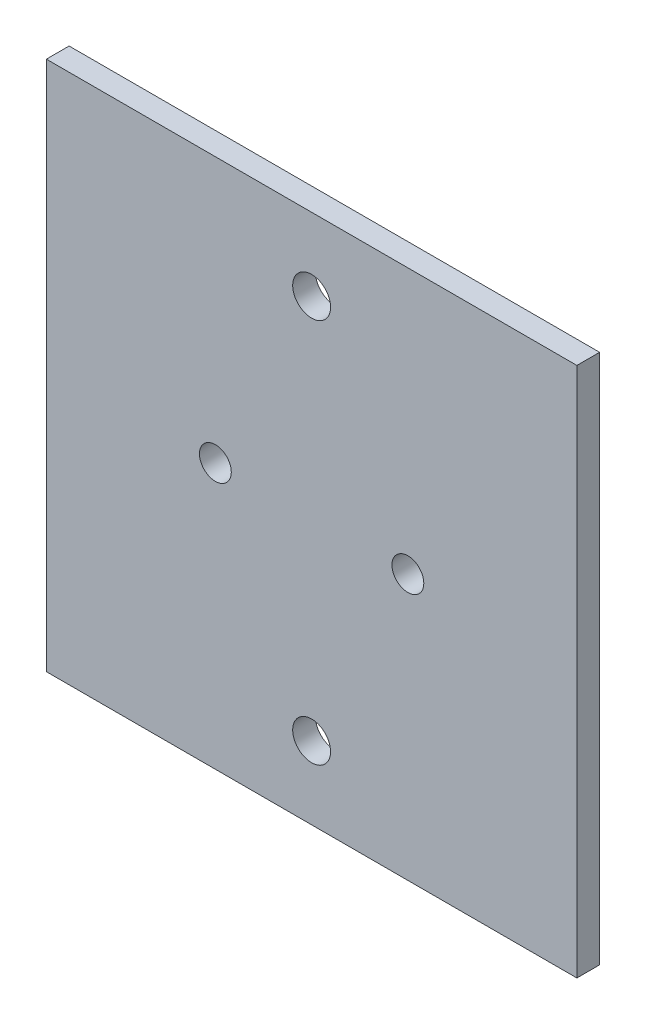
ISO-10303-21;
HEADER;
FILE_DESCRIPTION(('STEP AP214'),'2;1');
FILE_NAME('part.step','',(''),(''),'','','');
FILE_SCHEMA(('AUTOMOTIVE_DESIGN { 1 0 10303 214 1 1 1 1 }'));
ENDSEC;
DATA;
#1=APPLICATION_CONTEXT('core data for automotive mechanical design processes');
#2=APPLICATION_PROTOCOL_DEFINITION('international standard','automotive_design',2000,#1);
#3=PRODUCT_CONTEXT('',#1,'mechanical');
#4=PRODUCT('Part','Part','',(#3));
#5=PRODUCT_RELATED_PRODUCT_CATEGORY('part','',(#4));
#6=PRODUCT_DEFINITION_FORMATION('','',#4);
#7=PRODUCT_DEFINITION_CONTEXT('part definition',#1,'design');
#8=PRODUCT_DEFINITION('design','',#6,#7);
#9=PRODUCT_DEFINITION_SHAPE('','',#8);
#10=(LENGTH_UNIT() NAMED_UNIT(*) SI_UNIT(.MILLI.,.METRE.));
#11=(NAMED_UNIT(*) PLANE_ANGLE_UNIT() SI_UNIT($,.RADIAN.));
#12=(NAMED_UNIT(*) SI_UNIT($,.STERADIAN.) SOLID_ANGLE_UNIT());
#13=UNCERTAINTY_MEASURE_WITH_UNIT(LENGTH_MEASURE(1.E-05),#10,'distance_accuracy_value','');
#14=(GEOMETRIC_REPRESENTATION_CONTEXT(3) GLOBAL_UNCERTAINTY_ASSIGNED_CONTEXT((#13)) GLOBAL_UNIT_ASSIGNED_CONTEXT((#10,
#11,#12)) REPRESENTATION_CONTEXT('',''));
#15=CARTESIAN_POINT('',(0.,0.,0.));
#16=DIRECTION('',(0.,0.,1.));
#17=DIRECTION('',(1.,0.,0.));
#18=AXIS2_PLACEMENT_3D('',#15,#16,#17);
#19=CARTESIAN_POINT('',(0.,0.,3.));
#20=DIRECTION('',(0.,0.,1.));
#21=DIRECTION('',(1.,0.,0.));
#22=AXIS2_PLACEMENT_3D('',#19,#20,#21);
#23=PLANE('',#22);
#24=CARTESIAN_POINT('',(-12.7,0.,3.));
#25=DIRECTION('',(0.,0.,1.));
#26=DIRECTION('',(1.,0.,0.));
#27=AXIS2_PLACEMENT_3D('',#24,#25,#26);
#28=CIRCLE('',#27,2.1);
#29=CARTESIAN_POINT('',(-10.6,0.,3.));
#30=VERTEX_POINT('',#29);
#31=EDGE_CURVE('E149',#30,#30,#28,.T.);
#32=ORIENTED_EDGE('',*,*,#31,.F.);
#33=EDGE_LOOP('',(#32));
#34=FACE_BOUND('',#33,.T.);
#35=CARTESIAN_POINT('',(12.7,0.,3.));
#36=DIRECTION('',(0.,0.,1.));
#37=DIRECTION('',(1.,0.,0.));
#38=AXIS2_PLACEMENT_3D('',#35,#36,#37);
#39=CIRCLE('',#38,2.1);
#40=CARTESIAN_POINT('',(14.8,0.,3.));
#41=VERTEX_POINT('',#40);
#42=EDGE_CURVE('E150',#41,#41,#39,.T.);
#43=ORIENTED_EDGE('',*,*,#42,.F.);
#44=EDGE_LOOP('',(#43));
#45=FACE_BOUND('',#44,.T.);
#46=CARTESIAN_POINT('',(0.,25.4,3.));
#47=DIRECTION('',(0.,0.,1.));
#48=DIRECTION('',(1.,0.,0.));
#49=AXIS2_PLACEMENT_3D('',#46,#47,#48);
#50=CIRCLE('',#49,2.5);
#51=CARTESIAN_POINT('',(2.49999999999999,25.4,3.));
#52=VERTEX_POINT('',#51);
#53=EDGE_CURVE('E111',#52,#52,#50,.T.);
#54=ORIENTED_EDGE('',*,*,#53,.F.);
#55=EDGE_LOOP('',(#54));
#56=FACE_BOUND('',#55,.T.);
#57=DIRECTION('',(0.,1.,0.));
#58=VECTOR('',#57,1.);
#59=CARTESIAN_POINT('',(35.,35.,3.));
#60=LINE('',#59,#58);
#61=CARTESIAN_POINT('',(35.,-35.,3.));
#62=VERTEX_POINT('',#61);
#63=CARTESIAN_POINT('',(35.,35.,3.));
#64=VERTEX_POINT('',#63);
#65=EDGE_CURVE('E91',#62,#64,#60,.T.);
#66=ORIENTED_EDGE('',*,*,#65,.T.);
#67=DIRECTION('',(-1.,0.,0.));
#68=VECTOR('',#67,1.);
#69=CARTESIAN_POINT('',(-35.,35.,3.));
#70=LINE('',#69,#68);
#71=CARTESIAN_POINT('',(-35.,35.,3.));
#72=VERTEX_POINT('',#71);
#73=EDGE_CURVE('E86',#64,#72,#70,.T.);
#74=ORIENTED_EDGE('',*,*,#73,.T.);
#75=DIRECTION('',(0.,-1.,0.));
#76=VECTOR('',#75,1.);
#77=CARTESIAN_POINT('',(-35.,35.,3.));
#78=LINE('',#77,#76);
#79=CARTESIAN_POINT('',(-35.,-35.,3.));
#80=VERTEX_POINT('',#79);
#81=EDGE_CURVE('E89',#72,#80,#78,.T.);
#82=ORIENTED_EDGE('',*,*,#81,.T.);
#83=DIRECTION('',(1.,0.,0.));
#84=VECTOR('',#83,1.);
#85=CARTESIAN_POINT('',(-35.,-35.,3.));
#86=LINE('',#85,#84);
#87=EDGE_CURVE('E56',#80,#62,#86,.T.);
#88=ORIENTED_EDGE('',*,*,#87,.T.);
#89=EDGE_LOOP('',(#66,#74,#82,#88));
#90=FACE_BOUND('',#89,.T.);
#91=CARTESIAN_POINT('',(0.,-25.4,3.));
#92=DIRECTION('',(0.,0.,1.));
#93=DIRECTION('',(1.,0.,0.));
#94=AXIS2_PLACEMENT_3D('',#91,#92,#93);
#95=CIRCLE('',#94,2.5);
#96=CARTESIAN_POINT('',(2.5,-25.4,3.));
#97=VERTEX_POINT('',#96);
#98=EDGE_CURVE('E133',#97,#97,#95,.T.);
#99=ORIENTED_EDGE('',*,*,#98,.F.);
#100=EDGE_LOOP('',(#99));
#101=FACE_BOUND('',#100,.T.);
#102=ADVANCED_FACE('F38',(#34,#45,#56,#90,#101),#23,.T.);
#103=CARTESIAN_POINT('',(0.,0.,0.));
#104=DIRECTION('',(0.,0.,1.));
#105=DIRECTION('',(1.,0.,0.));
#106=AXIS2_PLACEMENT_3D('',#103,#104,#105);
#107=PLANE('',#106);
#108=CARTESIAN_POINT('',(-12.7,0.,0.));
#109=DIRECTION('',(0.,0.,1.));
#110=DIRECTION('',(1.,0.,0.));
#111=AXIS2_PLACEMENT_3D('',#108,#109,#110);
#112=CIRCLE('',#111,2.1);
#113=CARTESIAN_POINT('',(-10.6,0.,0.));
#114=VERTEX_POINT('',#113);
#115=EDGE_CURVE('E141',#114,#114,#112,.F.);
#116=ORIENTED_EDGE('',*,*,#115,.F.);
#117=EDGE_LOOP('',(#116));
#118=FACE_BOUND('',#117,.T.);
#119=CARTESIAN_POINT('',(12.7,0.,0.));
#120=DIRECTION('',(0.,0.,1.));
#121=DIRECTION('',(1.,0.,0.));
#122=AXIS2_PLACEMENT_3D('',#119,#120,#121);
#123=CIRCLE('',#122,2.1);
#124=CARTESIAN_POINT('',(14.8,0.,0.));
#125=VERTEX_POINT('',#124);
#126=EDGE_CURVE('E145',#125,#125,#123,.F.);
#127=ORIENTED_EDGE('',*,*,#126,.F.);
#128=EDGE_LOOP('',(#127));
#129=FACE_BOUND('',#128,.T.);
#130=DIRECTION('',(0.,1.,0.));
#131=VECTOR('',#130,1.);
#132=CARTESIAN_POINT('',(35.,35.,0.));
#133=LINE('',#132,#131);
#134=CARTESIAN_POINT('',(35.,-35.,0.));
#135=VERTEX_POINT('',#134);
#136=CARTESIAN_POINT('',(35.,35.,0.));
#137=VERTEX_POINT('',#136);
#138=EDGE_CURVE('E107',#135,#137,#133,.T.);
#139=ORIENTED_EDGE('',*,*,#138,.F.);
#140=DIRECTION('',(1.,0.,0.));
#141=VECTOR('',#140,1.);
#142=CARTESIAN_POINT('',(-35.,-35.,0.));
#143=LINE('',#142,#141);
#144=CARTESIAN_POINT('',(-35.,-35.,0.));
#145=VERTEX_POINT('',#144);
#146=EDGE_CURVE('E79',#145,#135,#143,.T.);
#147=ORIENTED_EDGE('',*,*,#146,.F.);
#148=DIRECTION('',(0.,-1.,0.));
#149=VECTOR('',#148,1.);
#150=CARTESIAN_POINT('',(-35.,35.,0.));
#151=LINE('',#150,#149);
#152=CARTESIAN_POINT('',(-35.,35.,0.));
#153=VERTEX_POINT('',#152);
#154=EDGE_CURVE('E73',#153,#145,#151,.T.);
#155=ORIENTED_EDGE('',*,*,#154,.F.);
#156=DIRECTION('',(-1.,0.,0.));
#157=VECTOR('',#156,1.);
#158=CARTESIAN_POINT('',(-35.,35.,0.));
#159=LINE('',#158,#157);
#160=EDGE_CURVE('E96',#137,#153,#159,.T.);
#161=ORIENTED_EDGE('',*,*,#160,.F.);
#162=EDGE_LOOP('',(#139,#147,#155,#161));
#163=FACE_BOUND('',#162,.T.);
#164=CARTESIAN_POINT('',(0.,25.4,0.));
#165=DIRECTION('',(0.,0.,1.));
#166=DIRECTION('',(1.,0.,0.));
#167=AXIS2_PLACEMENT_3D('',#164,#165,#166);
#168=CIRCLE('',#167,2.5);
#169=CARTESIAN_POINT('',(2.49999999999999,25.4,0.));
#170=VERTEX_POINT('',#169);
#171=EDGE_CURVE('E129',#170,#170,#168,.T.);
#172=ORIENTED_EDGE('',*,*,#171,.T.);
#173=EDGE_LOOP('',(#172));
#174=FACE_BOUND('',#173,.T.);
#175=CARTESIAN_POINT('',(0.,-25.4,0.));
#176=DIRECTION('',(0.,0.,1.));
#177=DIRECTION('',(1.,0.,0.));
#178=AXIS2_PLACEMENT_3D('',#175,#176,#177);
#179=CIRCLE('',#178,2.5);
#180=CARTESIAN_POINT('',(2.5,-25.4,0.));
#181=VERTEX_POINT('',#180);
#182=EDGE_CURVE('E137',#181,#181,#179,.T.);
#183=ORIENTED_EDGE('',*,*,#182,.T.);
#184=EDGE_LOOP('',(#183));
#185=FACE_BOUND('',#184,.T.);
#186=ADVANCED_FACE('F124',(#118,#129,#163,#174,#185),#107,.F.);
#187=CARTESIAN_POINT('',(35.,35.,3.));
#188=DIRECTION('',(-1.,0.,0.));
#189=DIRECTION('',(0.,-1.,0.));
#190=AXIS2_PLACEMENT_3D('',#187,#188,#189);
#191=PLANE('',#190);
#192=ORIENTED_EDGE('',*,*,#138,.T.);
#193=DIRECTION('',(0.,0.,-1.));
#194=VECTOR('',#193,1.);
#195=CARTESIAN_POINT('',(35.,35.,3.));
#196=LINE('',#195,#194);
#197=EDGE_CURVE('E11',#64,#137,#196,.T.);
#198=ORIENTED_EDGE('',*,*,#197,.F.);
#199=ORIENTED_EDGE('',*,*,#65,.F.);
#200=DIRECTION('',(0.,0.,-1.));
#201=VECTOR('',#200,1.);
#202=CARTESIAN_POINT('',(35.,-35.,3.));
#203=LINE('',#202,#201);
#204=EDGE_CURVE('E103',#62,#135,#203,.T.);
#205=ORIENTED_EDGE('',*,*,#204,.T.);
#206=EDGE_LOOP('',(#192,#198,#199,#205));
#207=FACE_BOUND('',#206,.T.);
#208=ADVANCED_FACE('F40',(#207),#191,.F.);
#209=CARTESIAN_POINT('',(-35.,35.,3.));
#210=DIRECTION('',(0.,-1.,0.));
#211=DIRECTION('',(0.,0.,-1.));
#212=AXIS2_PLACEMENT_3D('',#209,#210,#211);
#213=PLANE('',#212);
#214=ORIENTED_EDGE('',*,*,#160,.T.);
#215=DIRECTION('',(0.,0.,-1.));
#216=VECTOR('',#215,1.);
#217=CARTESIAN_POINT('',(-35.,35.,3.));
#218=LINE('',#217,#216);
#219=EDGE_CURVE('E48',#72,#153,#218,.T.);
#220=ORIENTED_EDGE('',*,*,#219,.F.);
#221=ORIENTED_EDGE('',*,*,#73,.F.);
#222=ORIENTED_EDGE('',*,*,#197,.T.);
#223=EDGE_LOOP('',(#214,#220,#221,#222));
#224=FACE_BOUND('',#223,.T.);
#225=ADVANCED_FACE('F95',(#224),#213,.F.);
#226=CARTESIAN_POINT('',(-35.,35.,3.));
#227=DIRECTION('',(1.,0.,0.));
#228=DIRECTION('',(0.,1.,0.));
#229=AXIS2_PLACEMENT_3D('',#226,#227,#228);
#230=PLANE('',#229);
#231=ORIENTED_EDGE('',*,*,#154,.T.);
#232=DIRECTION('',(0.,0.,-1.));
#233=VECTOR('',#232,1.);
#234=CARTESIAN_POINT('',(-35.,-35.,3.));
#235=LINE('',#234,#233);
#236=EDGE_CURVE('E98',#80,#145,#235,.T.);
#237=ORIENTED_EDGE('',*,*,#236,.F.);
#238=ORIENTED_EDGE('',*,*,#81,.F.);
#239=ORIENTED_EDGE('',*,*,#219,.T.);
#240=EDGE_LOOP('',(#231,#237,#238,#239));
#241=FACE_BOUND('',#240,.T.);
#242=ADVANCED_FACE('F99',(#241),#230,.F.);
#243=CARTESIAN_POINT('',(-35.,-35.,3.));
#244=DIRECTION('',(0.,1.,0.));
#245=DIRECTION('',(0.,0.,1.));
#246=AXIS2_PLACEMENT_3D('',#243,#244,#245);
#247=PLANE('',#246);
#248=ORIENTED_EDGE('',*,*,#146,.T.);
#249=ORIENTED_EDGE('',*,*,#204,.F.);
#250=ORIENTED_EDGE('',*,*,#87,.F.);
#251=ORIENTED_EDGE('',*,*,#236,.T.);
#252=EDGE_LOOP('',(#248,#249,#250,#251));
#253=FACE_BOUND('',#252,.T.);
#254=ADVANCED_FACE('F121',(#253),#247,.F.);
#255=CARTESIAN_POINT('',(0.,25.4,3.));
#256=DIRECTION('',(0.,0.,-1.));
#257=DIRECTION('',(-1.,0.,0.));
#258=AXIS2_PLACEMENT_3D('',#255,#256,#257);
#259=CYLINDRICAL_SURFACE('',#258,2.5);
#260=ORIENTED_EDGE('',*,*,#53,.T.);
#261=EDGE_LOOP('',(#260));
#262=FACE_BOUND('',#261,.T.);
#263=ORIENTED_EDGE('',*,*,#171,.F.);
#264=EDGE_LOOP('',(#263));
#265=FACE_BOUND('',#264,.T.);
#266=ADVANCED_FACE('F171',(#262,#265),#259,.F.);
#267=CARTESIAN_POINT('',(0.,-25.4,3.));
#268=DIRECTION('',(0.,0.,-1.));
#269=DIRECTION('',(-1.,0.,0.));
#270=AXIS2_PLACEMENT_3D('',#267,#268,#269);
#271=CYLINDRICAL_SURFACE('',#270,2.5);
#272=ORIENTED_EDGE('',*,*,#98,.T.);
#273=EDGE_LOOP('',(#272));
#274=FACE_BOUND('',#273,.T.);
#275=ORIENTED_EDGE('',*,*,#182,.F.);
#276=EDGE_LOOP('',(#275));
#277=FACE_BOUND('',#276,.T.);
#278=ADVANCED_FACE('F174',(#274,#277),#271,.F.);
#279=CARTESIAN_POINT('',(12.7,0.,-0.00100000000000013));
#280=DIRECTION('',(0.,0.,1.));
#281=DIRECTION('',(1.,0.,0.));
#282=AXIS2_PLACEMENT_3D('',#279,#280,#281);
#283=CYLINDRICAL_SURFACE('',#282,2.1);
#284=ORIENTED_EDGE('',*,*,#42,.T.);
#285=EDGE_LOOP('',(#284));
#286=FACE_BOUND('',#285,.T.);
#287=ORIENTED_EDGE('',*,*,#126,.T.);
#288=EDGE_LOOP('',(#287));
#289=FACE_BOUND('',#288,.T.);
#290=ADVANCED_FACE('F184',(#286,#289),#283,.F.);
#291=CARTESIAN_POINT('',(-12.7,0.,-0.00100000000000013));
#292=DIRECTION('',(0.,0.,1.));
#293=DIRECTION('',(1.,0.,0.));
#294=AXIS2_PLACEMENT_3D('',#291,#292,#293);
#295=CYLINDRICAL_SURFACE('',#294,2.1);
#296=ORIENTED_EDGE('',*,*,#31,.T.);
#297=EDGE_LOOP('',(#296));
#298=FACE_BOUND('',#297,.T.);
#299=ORIENTED_EDGE('',*,*,#115,.T.);
#300=EDGE_LOOP('',(#299));
#301=FACE_BOUND('',#300,.T.);
#302=ADVANCED_FACE('F161',(#298,#301),#295,.F.);
#303=CLOSED_SHELL('',(#102,#186,#208,#225,#242,#254,#266,#278,#290,#302));
#304=MANIFOLD_SOLID_BREP('B2',#303);
#305=ADVANCED_BREP_SHAPE_REPRESENTATION('',(#18,#304),#14);
#306=SHAPE_DEFINITION_REPRESENTATION(#9,#305);
ENDSEC;
END-ISO-10303-21;
